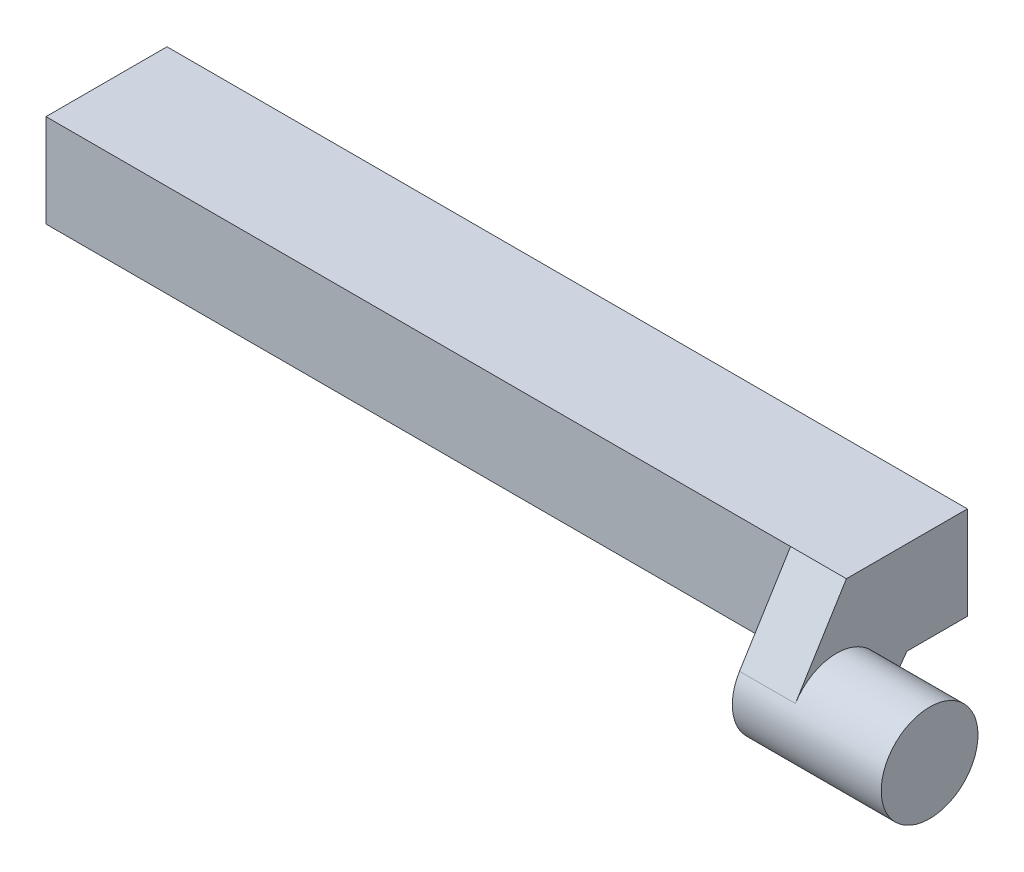
ISO-10303-21;
HEADER;
FILE_DESCRIPTION(('STEP AP214'),'2;1');
FILE_NAME('part.step','',(''),(''),'','','');
FILE_SCHEMA(('AUTOMOTIVE_DESIGN { 1 0 10303 214 1 1 1 1 }'));
ENDSEC;
DATA;
#1=APPLICATION_CONTEXT('core data for automotive mechanical design processes');
#2=APPLICATION_PROTOCOL_DEFINITION('international standard','automotive_design',2000,#1);
#3=PRODUCT_CONTEXT('',#1,'mechanical');
#4=PRODUCT('Part','Part','',(#3));
#5=PRODUCT_RELATED_PRODUCT_CATEGORY('part','',(#4));
#6=PRODUCT_DEFINITION_FORMATION('','',#4);
#7=PRODUCT_DEFINITION_CONTEXT('part definition',#1,'design');
#8=PRODUCT_DEFINITION('design','',#6,#7);
#9=PRODUCT_DEFINITION_SHAPE('','',#8);
#10=(LENGTH_UNIT() NAMED_UNIT(*) SI_UNIT(.MILLI.,.METRE.));
#11=(NAMED_UNIT(*) PLANE_ANGLE_UNIT() SI_UNIT($,.RADIAN.));
#12=(NAMED_UNIT(*) SI_UNIT($,.STERADIAN.) SOLID_ANGLE_UNIT());
#13=UNCERTAINTY_MEASURE_WITH_UNIT(LENGTH_MEASURE(1.E-05),#10,'distance_accuracy_value','');
#14=(GEOMETRIC_REPRESENTATION_CONTEXT(3) GLOBAL_UNCERTAINTY_ASSIGNED_CONTEXT((#13)) GLOBAL_UNIT_ASSIGNED_CONTEXT((#10,
#11,#12)) REPRESENTATION_CONTEXT('',''));
#15=CARTESIAN_POINT('',(0.,0.,0.));
#16=DIRECTION('',(0.,0.,1.));
#17=DIRECTION('',(1.,0.,0.));
#18=AXIS2_PLACEMENT_3D('',#15,#16,#17);
#19=CARTESIAN_POINT('',(0.,0.,0.));
#20=DIRECTION('',(1.,0.,0.));
#21=DIRECTION('',(0.,0.,-1.));
#22=AXIS2_PLACEMENT_3D('',#19,#20,#21);
#23=PLANE('',#22);
#24=DIRECTION('',(0.,-1.,0.));
#25=VECTOR('',#24,1.);
#26=CARTESIAN_POINT('',(0.,-2.5,3.25));
#27=LINE('',#26,#25);
#28=CARTESIAN_POINT('',(0.,2.5,3.25));
#29=VERTEX_POINT('',#28);
#30=CARTESIAN_POINT('',(0.,-2.5,3.25));
#31=VERTEX_POINT('',#30);
#32=EDGE_CURVE('E216',#29,#31,#27,.T.);
#33=ORIENTED_EDGE('',*,*,#32,.F.);
#34=DIRECTION('',(0.,0.,1.));
#35=VECTOR('',#34,1.);
#36=CARTESIAN_POINT('',(0.,2.5,-3.25));
#37=LINE('',#36,#35);
#38=CARTESIAN_POINT('',(0.,2.5,-3.25));
#39=VERTEX_POINT('',#38);
#40=EDGE_CURVE('E226',#39,#29,#37,.T.);
#41=ORIENTED_EDGE('',*,*,#40,.F.);
#42=DIRECTION('',(0.,1.,0.));
#43=VECTOR('',#42,1.);
#44=CARTESIAN_POINT('',(0.,-2.5,-3.25));
#45=LINE('',#44,#43);
#46=CARTESIAN_POINT('',(0.,-2.5,-3.25));
#47=VERTEX_POINT('',#46);
#48=EDGE_CURVE('E223',#47,#39,#45,.T.);
#49=ORIENTED_EDGE('',*,*,#48,.F.);
#50=DIRECTION('',(0.,0.,-1.));
#51=VECTOR('',#50,1.);
#52=CARTESIAN_POINT('',(0.,-2.5,-3.25));
#53=LINE('',#52,#51);
#54=EDGE_CURVE('E220',#31,#47,#53,.T.);
#55=ORIENTED_EDGE('',*,*,#54,.F.);
#56=EDGE_LOOP('',(#33,#41,#49,#55));
#57=FACE_BOUND('',#56,.T.);
#58=DIRECTION('',(0.,1.,0.));
#59=VECTOR('',#58,1.);
#60=CARTESIAN_POINT('',(0.,-2.25,-2.25));
#61=LINE('',#60,#59);
#62=CARTESIAN_POINT('',(0.,-2.25,-2.25));
#63=VERTEX_POINT('',#62);
#64=CARTESIAN_POINT('',(0.,2.25,-2.25));
#65=VERTEX_POINT('',#64);
#66=EDGE_CURVE('E172',#63,#65,#61,.T.);
#67=ORIENTED_EDGE('',*,*,#66,.T.);
#68=DIRECTION('',(0.,0.,1.));
#69=VECTOR('',#68,1.);
#70=CARTESIAN_POINT('',(0.,2.25,2.25));
#71=LINE('',#70,#69);
#72=CARTESIAN_POINT('',(0.,2.25,2.25));
#73=VERTEX_POINT('',#72);
#74=EDGE_CURVE('E192',#65,#73,#71,.T.);
#75=ORIENTED_EDGE('',*,*,#74,.T.);
#76=DIRECTION('',(0.,-1.,0.));
#77=VECTOR('',#76,1.);
#78=CARTESIAN_POINT('',(0.,-2.25,2.25));
#79=LINE('',#78,#77);
#80=CARTESIAN_POINT('',(0.,-2.25,2.25));
#81=VERTEX_POINT('',#80);
#82=EDGE_CURVE('E196',#73,#81,#79,.T.);
#83=ORIENTED_EDGE('',*,*,#82,.T.);
#84=DIRECTION('',(0.,0.,-1.));
#85=VECTOR('',#84,1.);
#86=CARTESIAN_POINT('',(0.,-2.25,2.25));
#87=LINE('',#86,#85);
#88=EDGE_CURVE('E178',#81,#63,#87,.T.);
#89=ORIENTED_EDGE('',*,*,#88,.T.);
#90=EDGE_LOOP('',(#67,#75,#83,#89));
#91=FACE_BOUND('',#90,.T.);
#92=ADVANCED_FACE('F41',(#57,#91),#23,.F.);
#93=CARTESIAN_POINT('',(2.,-2.5,3.25));
#94=DIRECTION('',(0.,0.,-1.));
#95=DIRECTION('',(-1.,0.,0.));
#96=AXIS2_PLACEMENT_3D('',#93,#94,#95);
#97=PLANE('',#96);
#98=ORIENTED_EDGE('',*,*,#32,.T.);
#99=DIRECTION('',(-1.,0.,0.));
#100=VECTOR('',#99,1.);
#101=CARTESIAN_POINT('',(2.,-2.5,3.25));
#102=LINE('',#101,#100);
#103=CARTESIAN_POINT('',(40.,-2.5,3.25));
#104=VERTEX_POINT('',#103);
#105=EDGE_CURVE('E45',#104,#31,#102,.T.);
#106=ORIENTED_EDGE('',*,*,#105,.F.);
#107=DIRECTION('',(0.,-1.,0.));
#108=VECTOR('',#107,1.);
#109=CARTESIAN_POINT('',(40.,0.,3.25));
#110=LINE('',#109,#108);
#111=CARTESIAN_POINT('',(40.,2.5,3.25));
#112=VERTEX_POINT('',#111);
#113=EDGE_CURVE('E164',#112,#104,#110,.T.);
#114=ORIENTED_EDGE('',*,*,#113,.F.);
#115=DIRECTION('',(-1.,0.,0.));
#116=VECTOR('',#115,1.);
#117=CARTESIAN_POINT('',(2.,2.5,3.25));
#118=LINE('',#117,#116);
#119=EDGE_CURVE('E229',#112,#29,#118,.T.);
#120=ORIENTED_EDGE('',*,*,#119,.T.);
#121=EDGE_LOOP('',(#98,#106,#114,#120));
#122=FACE_BOUND('',#121,.T.);
#123=ADVANCED_FACE('F43',(#122),#97,.F.);
#124=CARTESIAN_POINT('',(2.,-2.5,-3.25));
#125=DIRECTION('',(0.,1.,0.));
#126=DIRECTION('',(0.,0.,1.));
#127=AXIS2_PLACEMENT_3D('',#124,#125,#126);
#128=PLANE('',#127);
#129=ORIENTED_EDGE('',*,*,#54,.T.);
#130=DIRECTION('',(-1.,0.,0.));
#131=VECTOR('',#130,1.);
#132=CARTESIAN_POINT('',(2.,-2.5,-3.25));
#133=LINE('',#132,#131);
#134=CARTESIAN_POINT('',(43.,-2.5,-3.25));
#135=VERTEX_POINT('',#134);
#136=EDGE_CURVE('E236',#135,#47,#133,.T.);
#137=ORIENTED_EDGE('',*,*,#136,.F.);
#138=DIRECTION('',(0.,0.,-1.));
#139=VECTOR('',#138,1.);
#140=CARTESIAN_POINT('',(43.,-2.5,-3.25));
#141=LINE('',#140,#139);
#142=CARTESIAN_POINT('',(43.,-2.5,0.));
#143=VERTEX_POINT('',#142);
#144=EDGE_CURVE('E259',#143,#135,#141,.T.);
#145=ORIENTED_EDGE('',*,*,#144,.F.);
#146=DIRECTION('',(-1.,0.,0.));
#147=VECTOR('',#146,1.);
#148=CARTESIAN_POINT('',(43.,-2.5,0.));
#149=LINE('',#148,#147);
#150=CARTESIAN_POINT('',(40.,-2.5,0.));
#151=VERTEX_POINT('',#150);
#152=EDGE_CURVE('E160',#143,#151,#149,.T.);
#153=ORIENTED_EDGE('',*,*,#152,.T.);
#154=DIRECTION('',(0.,0.,-1.));
#155=VECTOR('',#154,1.);
#156=CARTESIAN_POINT('',(40.,-2.5,0.));
#157=LINE('',#156,#155);
#158=EDGE_CURVE('E58',#104,#151,#157,.T.);
#159=ORIENTED_EDGE('',*,*,#158,.F.);
#160=ORIENTED_EDGE('',*,*,#105,.T.);
#161=EDGE_LOOP('',(#129,#137,#145,#153,#159,#160));
#162=FACE_BOUND('',#161,.T.);
#163=ADVANCED_FACE('F245',(#162),#128,.F.);
#164=CARTESIAN_POINT('',(2.,-2.5,-3.25));
#165=DIRECTION('',(0.,0.,1.));
#166=DIRECTION('',(1.,0.,0.));
#167=AXIS2_PLACEMENT_3D('',#164,#165,#166);
#168=PLANE('',#167);
#169=ORIENTED_EDGE('',*,*,#48,.T.);
#170=DIRECTION('',(-1.,0.,0.));
#171=VECTOR('',#170,1.);
#172=CARTESIAN_POINT('',(2.,2.5,-3.25));
#173=LINE('',#172,#171);
#174=CARTESIAN_POINT('',(43.,2.5,-3.25));
#175=VERTEX_POINT('',#174);
#176=EDGE_CURVE('E233',#175,#39,#173,.T.);
#177=ORIENTED_EDGE('',*,*,#176,.F.);
#178=DIRECTION('',(0.,1.,0.));
#179=VECTOR('',#178,1.);
#180=CARTESIAN_POINT('',(43.,2.5,-3.25));
#181=LINE('',#180,#179);
#182=EDGE_CURVE('E256',#135,#175,#181,.T.);
#183=ORIENTED_EDGE('',*,*,#182,.F.);
#184=ORIENTED_EDGE('',*,*,#136,.T.);
#185=EDGE_LOOP('',(#169,#177,#183,#184));
#186=FACE_BOUND('',#185,.T.);
#187=ADVANCED_FACE('F252',(#186),#168,.F.);
#188=CARTESIAN_POINT('',(2.,2.5,-3.25));
#189=DIRECTION('',(0.,-1.,0.));
#190=DIRECTION('',(0.,0.,-1.));
#191=AXIS2_PLACEMENT_3D('',#188,#189,#190);
#192=PLANE('',#191);
#193=ORIENTED_EDGE('',*,*,#40,.T.);
#194=ORIENTED_EDGE('',*,*,#119,.F.);
#195=DIRECTION('',(-1.,0.,0.));
#196=VECTOR('',#195,1.);
#197=CARTESIAN_POINT('',(43.,2.5,3.25));
#198=LINE('',#197,#196);
#199=CARTESIAN_POINT('',(43.,2.5,3.25));
#200=VERTEX_POINT('',#199);
#201=EDGE_CURVE('E141',#200,#112,#198,.T.);
#202=ORIENTED_EDGE('',*,*,#201,.F.);
#203=DIRECTION('',(0.,0.,1.));
#204=VECTOR('',#203,1.);
#205=CARTESIAN_POINT('',(43.,2.5,3.25));
#206=LINE('',#205,#204);
#207=EDGE_CURVE('E148',#175,#200,#206,.T.);
#208=ORIENTED_EDGE('',*,*,#207,.F.);
#209=ORIENTED_EDGE('',*,*,#176,.T.);
#210=EDGE_LOOP('',(#193,#194,#202,#208,#209));
#211=FACE_BOUND('',#210,.T.);
#212=ADVANCED_FACE('F254',(#211),#192,.F.);
#213=CARTESIAN_POINT('',(2.,-2.25,-2.25));
#214=DIRECTION('',(0.,0.,1.));
#215=DIRECTION('',(1.,0.,0.));
#216=AXIS2_PLACEMENT_3D('',#213,#214,#215);
#217=PLANE('',#216);
#218=ORIENTED_EDGE('',*,*,#66,.F.);
#219=DIRECTION('',(-1.,0.,0.));
#220=VECTOR('',#219,1.);
#221=CARTESIAN_POINT('',(2.,-2.25,-2.25));
#222=LINE('',#221,#220);
#223=CARTESIAN_POINT('',(2.,-2.25,-2.25));
#224=VERTEX_POINT('',#223);
#225=EDGE_CURVE('E188',#224,#63,#222,.T.);
#226=ORIENTED_EDGE('',*,*,#225,.F.);
#227=DIRECTION('',(0.,1.,0.));
#228=VECTOR('',#227,1.);
#229=CARTESIAN_POINT('',(2.,-2.25,-2.25));
#230=LINE('',#229,#228);
#231=CARTESIAN_POINT('',(2.,2.25,-2.25));
#232=VERTEX_POINT('',#231);
#233=EDGE_CURVE('E173',#224,#232,#230,.T.);
#234=ORIENTED_EDGE('',*,*,#233,.T.);
#235=DIRECTION('',(-1.,0.,0.));
#236=VECTOR('',#235,1.);
#237=CARTESIAN_POINT('',(2.,2.25,-2.25));
#238=LINE('',#237,#236);
#239=EDGE_CURVE('E212',#232,#65,#238,.T.);
#240=ORIENTED_EDGE('',*,*,#239,.T.);
#241=EDGE_LOOP('',(#218,#226,#234,#240));
#242=FACE_BOUND('',#241,.T.);
#243=ADVANCED_FACE('F303',(#242),#217,.T.);
#244=CARTESIAN_POINT('',(2.,2.25,2.25));
#245=DIRECTION('',(0.,-1.,0.));
#246=DIRECTION('',(0.,0.,-1.));
#247=AXIS2_PLACEMENT_3D('',#244,#245,#246);
#248=PLANE('',#247);
#249=ORIENTED_EDGE('',*,*,#74,.F.);
#250=ORIENTED_EDGE('',*,*,#239,.F.);
#251=DIRECTION('',(0.,0.,1.));
#252=VECTOR('',#251,1.);
#253=CARTESIAN_POINT('',(2.,2.25,2.25));
#254=LINE('',#253,#252);
#255=CARTESIAN_POINT('',(2.,2.25,2.25));
#256=VERTEX_POINT('',#255);
#257=EDGE_CURVE('E177',#232,#256,#254,.T.);
#258=ORIENTED_EDGE('',*,*,#257,.T.);
#259=DIRECTION('',(-1.,0.,0.));
#260=VECTOR('',#259,1.);
#261=CARTESIAN_POINT('',(2.,2.25,2.25));
#262=LINE('',#261,#260);
#263=EDGE_CURVE('E209',#256,#73,#262,.T.);
#264=ORIENTED_EDGE('',*,*,#263,.T.);
#265=EDGE_LOOP('',(#249,#250,#258,#264));
#266=FACE_BOUND('',#265,.T.);
#267=ADVANCED_FACE('F328',(#266),#248,.T.);
#268=CARTESIAN_POINT('',(2.,-2.25,2.25));
#269=DIRECTION('',(0.,0.,-1.));
#270=DIRECTION('',(-1.,0.,0.));
#271=AXIS2_PLACEMENT_3D('',#268,#269,#270);
#272=PLANE('',#271);
#273=ORIENTED_EDGE('',*,*,#82,.F.);
#274=ORIENTED_EDGE('',*,*,#263,.F.);
#275=DIRECTION('',(0.,-1.,0.));
#276=VECTOR('',#275,1.);
#277=CARTESIAN_POINT('',(2.,-2.25,2.25));
#278=LINE('',#277,#276);
#279=CARTESIAN_POINT('',(2.,-2.25,2.25));
#280=VERTEX_POINT('',#279);
#281=EDGE_CURVE('E182',#256,#280,#278,.T.);
#282=ORIENTED_EDGE('',*,*,#281,.T.);
#283=DIRECTION('',(-1.,0.,0.));
#284=VECTOR('',#283,1.);
#285=CARTESIAN_POINT('',(2.,-2.25,2.25));
#286=LINE('',#285,#284);
#287=EDGE_CURVE('E206',#280,#81,#286,.T.);
#288=ORIENTED_EDGE('',*,*,#287,.T.);
#289=EDGE_LOOP('',(#273,#274,#282,#288));
#290=FACE_BOUND('',#289,.T.);
#291=ADVANCED_FACE('F335',(#290),#272,.T.);
#292=CARTESIAN_POINT('',(2.,-2.25,2.25));
#293=DIRECTION('',(0.,1.,0.));
#294=DIRECTION('',(0.,0.,1.));
#295=AXIS2_PLACEMENT_3D('',#292,#293,#294);
#296=PLANE('',#295);
#297=ORIENTED_EDGE('',*,*,#88,.F.);
#298=ORIENTED_EDGE('',*,*,#287,.F.);
#299=DIRECTION('',(0.,0.,-1.));
#300=VECTOR('',#299,1.);
#301=CARTESIAN_POINT('',(2.,-2.25,2.25));
#302=LINE('',#301,#300);
#303=EDGE_CURVE('E66',#280,#224,#302,.T.);
#304=ORIENTED_EDGE('',*,*,#303,.T.);
#305=ORIENTED_EDGE('',*,*,#225,.T.);
#306=EDGE_LOOP('',(#297,#298,#304,#305));
#307=FACE_BOUND('',#306,.T.);
#308=ADVANCED_FACE('F342',(#307),#296,.T.);
#309=CARTESIAN_POINT('',(2.,0.,0.));
#310=DIRECTION('',(1.,0.,0.));
#311=DIRECTION('',(0.,0.,-1.));
#312=AXIS2_PLACEMENT_3D('',#309,#310,#311);
#313=PLANE('',#312);
#314=ORIENTED_EDGE('',*,*,#257,.F.);
#315=ORIENTED_EDGE('',*,*,#233,.F.);
#316=ORIENTED_EDGE('',*,*,#303,.F.);
#317=ORIENTED_EDGE('',*,*,#281,.F.);
#318=EDGE_LOOP('',(#314,#315,#316,#317));
#319=FACE_BOUND('',#318,.T.);
#320=ADVANCED_FACE('F293',(#319),#313,.F.);
#321=CARTESIAN_POINT('',(40.,-3.30298390893109,3.78058160834285));
#322=DIRECTION('',(1.,0.,0.));
#323=DIRECTION('',(0.,0.,-1.));
#324=AXIS2_PLACEMENT_3D('',#321,#322,#323);
#325=PLANE('',#324);
#326=DIRECTION('',(0.,-0.850597325819403,0.525817638833922));
#327=VECTOR('',#326,1.);
#328=CARTESIAN_POINT('',(40.,-1.93585804796289,5.9921346554733));
#329=LINE('',#328,#327);
#330=CARTESIAN_POINT('',(40.,-1.93585804796289,5.9921346554733));
#331=VERTEX_POINT('',#330);
#332=EDGE_CURVE('E136',#112,#331,#329,.T.);
#333=ORIENTED_EDGE('',*,*,#332,.F.);
#334=ORIENTED_EDGE('',*,*,#113,.T.);
#335=ORIENTED_EDGE('',*,*,#158,.T.);
#336=DIRECTION('',(0.,0.811762164071028,-0.583988175379195));
#337=VECTOR('',#336,1.);
#338=CARTESIAN_POINT('',(40.,-2.5,0.));
#339=LINE('',#338,#337);
#340=CARTESIAN_POINT('',(40.,-4.82135316491699,1.66999998175818));
#341=VERTEX_POINT('',#340);
#342=EDGE_CURVE('E265',#341,#151,#339,.T.);
#343=ORIENTED_EDGE('',*,*,#342,.F.);
#344=CARTESIAN_POINT('',(40.,-3.30298390893109,3.78058160834285));
#345=DIRECTION('',(1.,0.,0.));
#346=DIRECTION('',(0.,0.,-1.));
#347=AXIS2_PLACEMENT_3D('',#344,#345,#346);
#348=CIRCLE('',#347,2.6);
#349=EDGE_CURVE('E157',#331,#341,#348,.T.);
#350=ORIENTED_EDGE('',*,*,#349,.F.);
#351=EDGE_LOOP('',(#333,#334,#335,#343,#350));
#352=FACE_BOUND('',#351,.T.);
#353=ADVANCED_FACE('F272',(#352),#325,.F.);
#354=CARTESIAN_POINT('',(43.,-3.30298390893109,3.78058160834285));
#355=DIRECTION('',(-1.,0.,0.));
#356=DIRECTION('',(0.,0.,1.));
#357=AXIS2_PLACEMENT_3D('',#354,#355,#356);
#358=CYLINDRICAL_SURFACE('',#357,2.6);
#359=ORIENTED_EDGE('',*,*,#349,.T.);
#360=DIRECTION('',(-1.,0.,0.));
#361=VECTOR('',#360,1.);
#362=CARTESIAN_POINT('',(43.,-4.82135316491699,1.66999998175818));
#363=LINE('',#362,#361);
#364=CARTESIAN_POINT('',(43.,-4.82135316491699,1.66999998175818));
#365=VERTEX_POINT('',#364);
#366=EDGE_CURVE('E156',#365,#341,#363,.T.);
#367=ORIENTED_EDGE('',*,*,#366,.F.);
#368=CARTESIAN_POINT('',(43.,-3.30298390893109,3.78058160834285));
#369=DIRECTION('',(1.,0.,0.));
#370=DIRECTION('',(0.,0.,-1.));
#371=AXIS2_PLACEMENT_3D('',#368,#369,#370);
#372=CIRCLE('',#371,2.6);
#373=CARTESIAN_POINT('',(43.,-1.93585804796289,5.9921346554733));
#374=VERTEX_POINT('',#373);
#375=EDGE_CURVE('E11',#365,#374,#372,.T.);
#376=ORIENTED_EDGE('',*,*,#375,.T.);
#377=DIRECTION('',(-1.,0.,0.));
#378=VECTOR('',#377,1.);
#379=CARTESIAN_POINT('',(43.,-1.93585804796289,5.9921346554733));
#380=LINE('',#379,#378);
#381=EDGE_CURVE('E130',#374,#331,#380,.T.);
#382=ORIENTED_EDGE('',*,*,#381,.T.);
#383=EDGE_LOOP('',(#359,#367,#376,#382));
#384=FACE_BOUND('',#383,.T.);
#385=CARTESIAN_POINT('',(48.,-3.30298390893109,3.78058160834285));
#386=DIRECTION('',(1.,0.,0.));
#387=DIRECTION('',(0.,0.,-1.));
#388=AXIS2_PLACEMENT_3D('',#385,#386,#387);
#389=CIRCLE('',#388,2.6);
#390=CARTESIAN_POINT('',(48.,-3.30298390893109,1.18058160834285));
#391=VERTEX_POINT('',#390);
#392=EDGE_CURVE('E266',#391,#391,#389,.T.);
#393=ORIENTED_EDGE('',*,*,#392,.F.);
#394=EDGE_LOOP('',(#393));
#395=FACE_BOUND('',#394,.T.);
#396=ADVANCED_FACE('F153',(#384,#395),#358,.T.);
#397=CARTESIAN_POINT('',(43.,-2.5,0.));
#398=DIRECTION('',(0.,0.583988175379195,0.811762164071028));
#399=DIRECTION('',(0.,-0.811762164071028,0.583988175379195));
#400=AXIS2_PLACEMENT_3D('',#397,#398,#399);
#401=PLANE('',#400);
#402=ORIENTED_EDGE('',*,*,#342,.T.);
#403=ORIENTED_EDGE('',*,*,#152,.F.);
#404=DIRECTION('',(0.,0.811762164071028,-0.583988175379195));
#405=VECTOR('',#404,1.);
#406=CARTESIAN_POINT('',(43.,-2.5,0.));
#407=LINE('',#406,#405);
#408=EDGE_CURVE('E270',#365,#143,#407,.T.);
#409=ORIENTED_EDGE('',*,*,#408,.F.);
#410=ORIENTED_EDGE('',*,*,#366,.T.);
#411=EDGE_LOOP('',(#402,#403,#409,#410));
#412=FACE_BOUND('',#411,.T.);
#413=ADVANCED_FACE('F274',(#412),#401,.F.);
#414=CARTESIAN_POINT('',(43.,-1.93585804796289,5.9921346554733));
#415=DIRECTION('',(0.,-0.525817638833922,-0.850597325819403));
#416=DIRECTION('',(0.,0.850597325819403,-0.525817638833922));
#417=AXIS2_PLACEMENT_3D('',#414,#415,#416);
#418=PLANE('',#417);
#419=ORIENTED_EDGE('',*,*,#332,.T.);
#420=ORIENTED_EDGE('',*,*,#381,.F.);
#421=DIRECTION('',(0.,-0.850597325819403,0.525817638833922));
#422=VECTOR('',#421,1.);
#423=CARTESIAN_POINT('',(43.,-1.93585804796289,5.9921346554733));
#424=LINE('',#423,#422);
#425=EDGE_CURVE('E134',#200,#374,#424,.T.);
#426=ORIENTED_EDGE('',*,*,#425,.F.);
#427=ORIENTED_EDGE('',*,*,#201,.T.);
#428=EDGE_LOOP('',(#419,#420,#426,#427));
#429=FACE_BOUND('',#428,.T.);
#430=ADVANCED_FACE('F132',(#429),#418,.F.);
#431=CARTESIAN_POINT('',(43.,-3.30298390893109,3.78058160834285));
#432=DIRECTION('',(1.,0.,0.));
#433=DIRECTION('',(0.,0.,-1.));
#434=AXIS2_PLACEMENT_3D('',#431,#432,#433);
#435=PLANE('',#434);
#436=ORIENTED_EDGE('',*,*,#375,.F.);
#437=ORIENTED_EDGE('',*,*,#408,.T.);
#438=ORIENTED_EDGE('',*,*,#144,.T.);
#439=ORIENTED_EDGE('',*,*,#182,.T.);
#440=ORIENTED_EDGE('',*,*,#207,.T.);
#441=ORIENTED_EDGE('',*,*,#425,.T.);
#442=EDGE_LOOP('',(#436,#437,#438,#439,#440,#441));
#443=FACE_BOUND('',#442,.T.);
#444=ADVANCED_FACE('F144',(#443),#435,.T.);
#445=CARTESIAN_POINT('',(48.,-3.30298390893109,3.78058160834285));
#446=DIRECTION('',(1.,0.,0.));
#447=DIRECTION('',(0.,0.,-1.));
#448=AXIS2_PLACEMENT_3D('',#445,#446,#447);
#449=PLANE('',#448);
#450=ORIENTED_EDGE('',*,*,#392,.T.);
#451=EDGE_LOOP('',(#450));
#452=FACE_BOUND('',#451,.T.);
#453=ADVANCED_FACE('F285',(#452),#449,.T.);
#454=CLOSED_SHELL('',(#92,#123,#163,#187,#212,#243,#267,#291,#308,#320,#353,#396,#413,#430,#444,#453));
#455=MANIFOLD_SOLID_BREP('B2',#454);
#456=ADVANCED_BREP_SHAPE_REPRESENTATION('',(#18,#455),#14);
#457=SHAPE_DEFINITION_REPRESENTATION(#9,#456);
ENDSEC;
END-ISO-10303-21;
